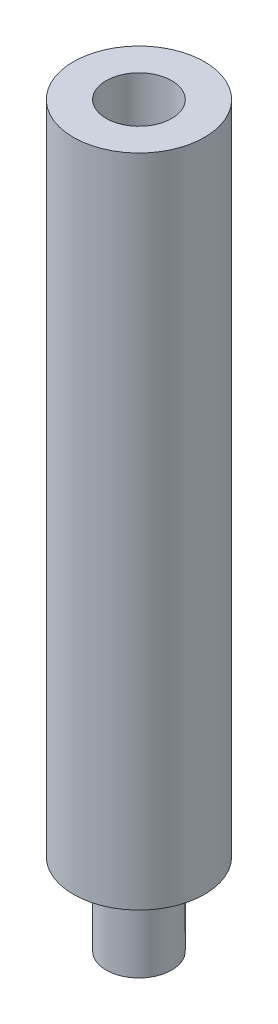
ISO-10303-21;
HEADER;
FILE_DESCRIPTION(('STEP AP214'),'2;1');
FILE_NAME('part.step','',(''),(''),'','','');
FILE_SCHEMA(('AUTOMOTIVE_DESIGN { 1 0 10303 214 1 1 1 1 }'));
ENDSEC;
DATA;
#1=APPLICATION_CONTEXT('core data for automotive mechanical design processes');
#2=APPLICATION_PROTOCOL_DEFINITION('international standard','automotive_design',2000,#1);
#3=PRODUCT_CONTEXT('',#1,'mechanical');
#4=PRODUCT('Part','Part','',(#3));
#5=PRODUCT_RELATED_PRODUCT_CATEGORY('part','',(#4));
#6=PRODUCT_DEFINITION_FORMATION('','',#4);
#7=PRODUCT_DEFINITION_CONTEXT('part definition',#1,'design');
#8=PRODUCT_DEFINITION('design','',#6,#7);
#9=PRODUCT_DEFINITION_SHAPE('','',#8);
#10=(LENGTH_UNIT() NAMED_UNIT(*) SI_UNIT(.MILLI.,.METRE.));
#11=(NAMED_UNIT(*) PLANE_ANGLE_UNIT() SI_UNIT($,.RADIAN.));
#12=(NAMED_UNIT(*) SI_UNIT($,.STERADIAN.) SOLID_ANGLE_UNIT());
#13=UNCERTAINTY_MEASURE_WITH_UNIT(LENGTH_MEASURE(1.E-05),#10,'distance_accuracy_value','');
#14=(GEOMETRIC_REPRESENTATION_CONTEXT(3) GLOBAL_UNCERTAINTY_ASSIGNED_CONTEXT((#13)) GLOBAL_UNIT_ASSIGNED_CONTEXT((#10,
#11,#12)) REPRESENTATION_CONTEXT('',''));
#15=CARTESIAN_POINT('',(0.,0.,0.));
#16=DIRECTION('',(0.,0.,1.));
#17=DIRECTION('',(1.,0.,0.));
#18=AXIS2_PLACEMENT_3D('',#15,#16,#17);
#19=CARTESIAN_POINT('',(0.,-40.,0.));
#20=DIRECTION('',(0.,1.,0.));
#21=DIRECTION('',(0.,0.,1.));
#22=AXIS2_PLACEMENT_3D('',#19,#20,#21);
#23=CYLINDRICAL_SURFACE('',#22,4.);
#24=CARTESIAN_POINT('',(0.,-40.,0.));
#25=DIRECTION('',(0.,1.,0.));
#26=DIRECTION('',(0.,0.,1.));
#27=AXIS2_PLACEMENT_3D('',#24,#25,#26);
#28=CIRCLE('',#27,4.);
#29=CARTESIAN_POINT('',(0.,-40.,4.));
#30=VERTEX_POINT('',#29);
#31=EDGE_CURVE('E49',#30,#30,#28,.T.);
#32=ORIENTED_EDGE('',*,*,#31,.T.);
#33=EDGE_LOOP('',(#32));
#34=FACE_BOUND('',#33,.T.);
#35=CARTESIAN_POINT('',(0.,0.,0.));
#36=DIRECTION('',(0.,1.,0.));
#37=DIRECTION('',(0.,0.,1.));
#38=AXIS2_PLACEMENT_3D('',#35,#36,#37);
#39=CIRCLE('',#38,4.);
#40=CARTESIAN_POINT('',(0.,0.,4.));
#41=VERTEX_POINT('',#40);
#42=EDGE_CURVE('E44',#41,#41,#39,.T.);
#43=ORIENTED_EDGE('',*,*,#42,.F.);
#44=EDGE_LOOP('',(#43));
#45=FACE_BOUND('',#44,.T.);
#46=ADVANCED_FACE('F41',(#34,#45),#23,.T.);
#47=CARTESIAN_POINT('',(0.,-40.,0.));
#48=DIRECTION('',(0.,1.,0.));
#49=DIRECTION('',(0.,0.,1.));
#50=AXIS2_PLACEMENT_3D('',#47,#48,#49);
#51=PLANE('',#50);
#52=CARTESIAN_POINT('',(0.,-40.,0.));
#53=DIRECTION('',(0.,-1.,0.));
#54=DIRECTION('',(0.,0.,-1.));
#55=AXIS2_PLACEMENT_3D('',#52,#53,#54);
#56=CIRCLE('',#55,2.);
#57=CARTESIAN_POINT('',(0.,-40.,-2.));
#58=VERTEX_POINT('',#57);
#59=EDGE_CURVE('E10',#58,#58,#56,.T.);
#60=ORIENTED_EDGE('',*,*,#59,.F.);
#61=EDGE_LOOP('',(#60));
#62=FACE_BOUND('',#61,.T.);
#63=ORIENTED_EDGE('',*,*,#31,.F.);
#64=EDGE_LOOP('',(#63));
#65=FACE_BOUND('',#64,.T.);
#66=ADVANCED_FACE('F86',(#62,#65),#51,.F.);
#67=CARTESIAN_POINT('',(0.,0.,0.));
#68=DIRECTION('',(0.,1.,0.));
#69=DIRECTION('',(0.,0.,1.));
#70=AXIS2_PLACEMENT_3D('',#67,#68,#69);
#71=PLANE('',#70);
#72=CARTESIAN_POINT('',(0.,0.,0.));
#73=DIRECTION('',(0.,1.,0.));
#74=DIRECTION('',(0.,0.,1.));
#75=AXIS2_PLACEMENT_3D('',#72,#73,#74);
#76=CIRCLE('',#75,2.);
#77=CARTESIAN_POINT('',(0.,0.,2.));
#78=VERTEX_POINT('',#77);
#79=EDGE_CURVE('E62',#78,#78,#76,.T.);
#80=ORIENTED_EDGE('',*,*,#79,.F.);
#81=EDGE_LOOP('',(#80));
#82=FACE_BOUND('',#81,.T.);
#83=ORIENTED_EDGE('',*,*,#42,.T.);
#84=EDGE_LOOP('',(#83));
#85=FACE_BOUND('',#84,.T.);
#86=ADVANCED_FACE('F91',(#82,#85),#71,.T.);
#87=CARTESIAN_POINT('',(0.,-10.,0.));
#88=DIRECTION('',(0.,1.,0.));
#89=DIRECTION('',(0.,0.,1.));
#90=AXIS2_PLACEMENT_3D('',#87,#88,#89);
#91=CYLINDRICAL_SURFACE('',#90,2.);
#92=CARTESIAN_POINT('',(0.,-10.,0.));
#93=DIRECTION('',(0.,1.,0.));
#94=DIRECTION('',(0.,0.,1.));
#95=AXIS2_PLACEMENT_3D('',#92,#93,#94);
#96=CIRCLE('',#95,2.);
#97=CARTESIAN_POINT('',(0.,-10.,2.));
#98=VERTEX_POINT('',#97);
#99=EDGE_CURVE('E58',#98,#98,#96,.T.);
#100=ORIENTED_EDGE('',*,*,#99,.F.);
#101=EDGE_LOOP('',(#100));
#102=FACE_BOUND('',#101,.T.);
#103=ORIENTED_EDGE('',*,*,#79,.T.);
#104=EDGE_LOOP('',(#103));
#105=FACE_BOUND('',#104,.T.);
#106=ADVANCED_FACE('F82',(#102,#105),#91,.F.);
#107=CARTESIAN_POINT('',(0.,-10.,0.));
#108=DIRECTION('',(0.,1.,0.));
#109=DIRECTION('',(0.,0.,1.));
#110=AXIS2_PLACEMENT_3D('',#107,#108,#109);
#111=PLANE('',#110);
#112=ORIENTED_EDGE('',*,*,#99,.T.);
#113=EDGE_LOOP('',(#112));
#114=FACE_BOUND('',#113,.T.);
#115=ADVANCED_FACE('F75',(#114),#111,.T.);
#116=CARTESIAN_POINT('',(0.,-45.,0.));
#117=DIRECTION('',(0.,1.,0.));
#118=DIRECTION('',(0.,0.,1.));
#119=AXIS2_PLACEMENT_3D('',#116,#117,#118);
#120=CYLINDRICAL_SURFACE('',#119,2.);
#121=CARTESIAN_POINT('',(0.,-45.,0.));
#122=DIRECTION('',(0.,-1.,0.));
#123=DIRECTION('',(0.,0.,-1.));
#124=AXIS2_PLACEMENT_3D('',#121,#122,#123);
#125=CIRCLE('',#124,2.);
#126=CARTESIAN_POINT('',(0.,-45.,-2.));
#127=VERTEX_POINT('',#126);
#128=EDGE_CURVE('E57',#127,#127,#125,.T.);
#129=ORIENTED_EDGE('',*,*,#128,.F.);
#130=EDGE_LOOP('',(#129));
#131=FACE_BOUND('',#130,.T.);
#132=ORIENTED_EDGE('',*,*,#59,.T.);
#133=EDGE_LOOP('',(#132));
#134=FACE_BOUND('',#133,.T.);
#135=ADVANCED_FACE('F73',(#131,#134),#120,.T.);
#136=CARTESIAN_POINT('',(0.,-45.,0.));
#137=DIRECTION('',(0.,-1.,0.));
#138=DIRECTION('',(0.,0.,-1.));
#139=AXIS2_PLACEMENT_3D('',#136,#137,#138);
#140=PLANE('',#139);
#141=ORIENTED_EDGE('',*,*,#128,.T.);
#142=EDGE_LOOP('',(#141));
#143=FACE_BOUND('',#142,.T.);
#144=ADVANCED_FACE('F71',(#143),#140,.T.);
#145=CLOSED_SHELL('',(#46,#66,#86,#106,#115,#135,#144));
#146=MANIFOLD_SOLID_BREP('B2',#145);
#147=ADVANCED_BREP_SHAPE_REPRESENTATION('',(#18,#146),#14);
#148=SHAPE_DEFINITION_REPRESENTATION(#9,#147);
ENDSEC;
END-ISO-10303-21;
